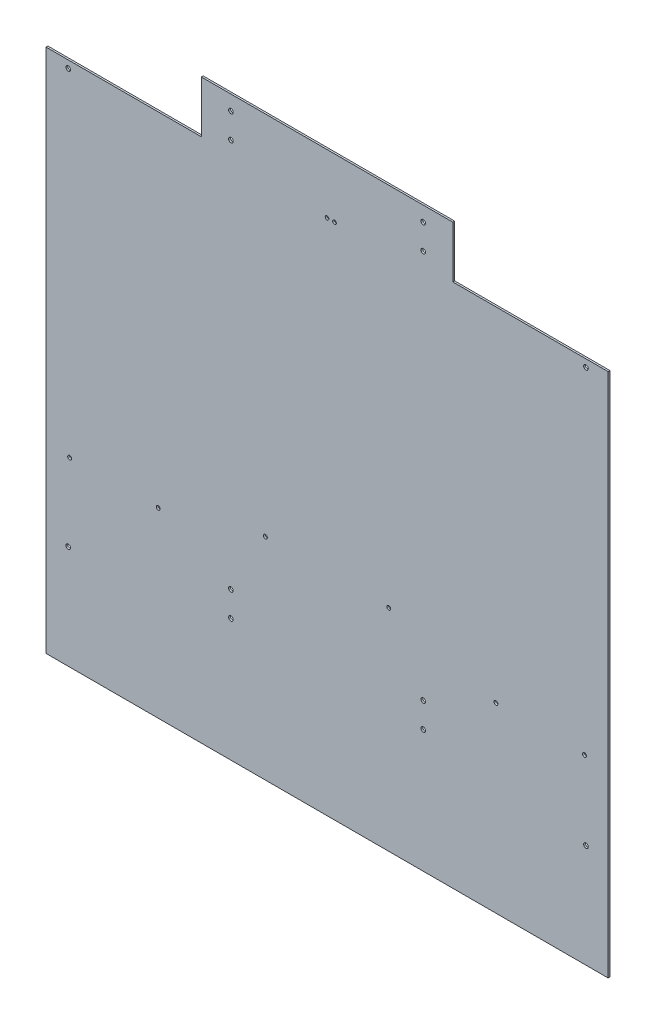
ISO-10303-21;
HEADER;
FILE_DESCRIPTION(('STEP AP214'),'2;1');
FILE_NAME('part.step','',(''),(''),'','','');
FILE_SCHEMA(('AUTOMOTIVE_DESIGN { 1 0 10303 214 1 1 1 1 }'));
ENDSEC;
DATA;
#1=APPLICATION_CONTEXT('core data for automotive mechanical design processes');
#2=APPLICATION_PROTOCOL_DEFINITION('international standard','automotive_design',2000,#1);
#3=PRODUCT_CONTEXT('',#1,'mechanical');
#4=PRODUCT('Part','Part','',(#3));
#5=PRODUCT_RELATED_PRODUCT_CATEGORY('part','',(#4));
#6=PRODUCT_DEFINITION_FORMATION('','',#4);
#7=PRODUCT_DEFINITION_CONTEXT('part definition',#1,'design');
#8=PRODUCT_DEFINITION('design','',#6,#7);
#9=PRODUCT_DEFINITION_SHAPE('','',#8);
#10=(LENGTH_UNIT() NAMED_UNIT(*) SI_UNIT(.MILLI.,.METRE.));
#11=(NAMED_UNIT(*) PLANE_ANGLE_UNIT() SI_UNIT($,.RADIAN.));
#12=(NAMED_UNIT(*) SI_UNIT($,.STERADIAN.) SOLID_ANGLE_UNIT());
#13=UNCERTAINTY_MEASURE_WITH_UNIT(LENGTH_MEASURE(1.E-05),#10,'distance_accuracy_value','');
#14=(GEOMETRIC_REPRESENTATION_CONTEXT(3) GLOBAL_UNCERTAINTY_ASSIGNED_CONTEXT((#13)) GLOBAL_UNIT_ASSIGNED_CONTEXT((#10,
#11,#12)) REPRESENTATION_CONTEXT('',''));
#15=CARTESIAN_POINT('',(0.,0.,0.));
#16=DIRECTION('',(0.,0.,1.));
#17=DIRECTION('',(1.,0.,0.));
#18=AXIS2_PLACEMENT_3D('',#15,#16,#17);
#19=CARTESIAN_POINT('',(0.,0.,0.));
#20=DIRECTION('',(0.,0.,-1.));
#21=DIRECTION('',(-1.,0.,0.));
#22=AXIS2_PLACEMENT_3D('',#19,#20,#21);
#23=PLANE('',#22);
#24=CARTESIAN_POINT('',(0.,889.,0.));
#25=DIRECTION('',(0.,0.,1.));
#26=DIRECTION('',(1.,0.,0.));
#27=AXIS2_PLACEMENT_3D('',#24,#25,#26);
#28=CIRCLE('',#27,3.175);
#29=CARTESIAN_POINT('',(3.175,889.,0.));
#30=VERTEX_POINT('',#29);
#31=EDGE_CURVE('E295',#30,#30,#28,.T.);
#32=ORIENTED_EDGE('',*,*,#31,.T.);
#33=EDGE_LOOP('',(#32));
#34=FACE_BOUND('',#33,.T.);
#35=CARTESIAN_POINT('',(12.7,889.,0.));
#36=DIRECTION('',(0.,0.,1.));
#37=DIRECTION('',(1.,0.,0.));
#38=AXIS2_PLACEMENT_3D('',#35,#36,#37);
#39=CIRCLE('',#38,3.175);
#40=CARTESIAN_POINT('',(15.875,889.,0.));
#41=VERTEX_POINT('',#40);
#42=EDGE_CURVE('E289',#41,#41,#39,.T.);
#43=ORIENTED_EDGE('',*,*,#42,.T.);
#44=EDGE_LOOP('',(#43));
#45=FACE_BOUND('',#44,.T.);
#46=CARTESIAN_POINT('',(-165.1,922.02,0.));
#47=DIRECTION('',(0.,0.,1.));
#48=DIRECTION('',(1.,0.,0.));
#49=AXIS2_PLACEMENT_3D('',#46,#47,#48);
#50=CIRCLE('',#49,3.96874999999999);
#51=CARTESIAN_POINT('',(-161.13125,922.02,0.));
#52=VERTEX_POINT('',#51);
#53=EDGE_CURVE('E283',#52,#52,#50,.T.);
#54=ORIENTED_EDGE('',*,*,#53,.T.);
#55=EDGE_LOOP('',(#54));
#56=FACE_BOUND('',#55,.T.);
#57=CARTESIAN_POINT('',(-165.1,965.2,0.));
#58=DIRECTION('',(0.,0.,1.));
#59=DIRECTION('',(1.,0.,0.));
#60=AXIS2_PLACEMENT_3D('',#57,#58,#59);
#61=CIRCLE('',#60,3.96874999999999);
#62=CARTESIAN_POINT('',(-161.13125,965.2,0.));
#63=VERTEX_POINT('',#62);
#64=EDGE_CURVE('E277',#63,#63,#61,.T.);
#65=ORIENTED_EDGE('',*,*,#64,.T.);
#66=EDGE_LOOP('',(#65));
#67=FACE_BOUND('',#66,.T.);
#68=CARTESIAN_POINT('',(165.099999999979,965.2,0.));
#69=DIRECTION('',(0.,0.,1.));
#70=DIRECTION('',(1.,0.,0.));
#71=AXIS2_PLACEMENT_3D('',#68,#69,#70);
#72=CIRCLE('',#71,3.96874999999999);
#73=CARTESIAN_POINT('',(169.068749999979,965.2,0.));
#74=VERTEX_POINT('',#73);
#75=EDGE_CURVE('E271',#74,#74,#72,.T.);
#76=ORIENTED_EDGE('',*,*,#75,.T.);
#77=EDGE_LOOP('',(#76));
#78=FACE_BOUND('',#77,.T.);
#79=CARTESIAN_POINT('',(165.099999999979,922.02,0.));
#80=DIRECTION('',(0.,0.,1.));
#81=DIRECTION('',(1.,0.,0.));
#82=AXIS2_PLACEMENT_3D('',#79,#80,#81);
#83=CIRCLE('',#82,3.96874999999999);
#84=CARTESIAN_POINT('',(169.068749999979,922.02,0.));
#85=VERTEX_POINT('',#84);
#86=EDGE_CURVE('E265',#85,#85,#83,.T.);
#87=ORIENTED_EDGE('',*,*,#86,.T.);
#88=EDGE_LOOP('',(#87));
#89=FACE_BOUND('',#88,.T.);
#90=CARTESIAN_POINT('',(-165.099999999993,210.82,0.));
#91=DIRECTION('',(0.,0.,1.));
#92=DIRECTION('',(1.,0.,0.));
#93=AXIS2_PLACEMENT_3D('',#90,#91,#92);
#94=CIRCLE('',#93,3.96874999999999);
#95=CARTESIAN_POINT('',(-161.131249999993,210.82,0.));
#96=VERTEX_POINT('',#95);
#97=EDGE_CURVE('E259',#96,#96,#94,.T.);
#98=ORIENTED_EDGE('',*,*,#97,.T.);
#99=EDGE_LOOP('',(#98));
#100=FACE_BOUND('',#99,.T.);
#101=CARTESIAN_POINT('',(-165.099999999993,254.,0.));
#102=DIRECTION('',(0.,0.,1.));
#103=DIRECTION('',(1.,0.,0.));
#104=AXIS2_PLACEMENT_3D('',#101,#102,#103);
#105=CIRCLE('',#104,3.96874999999999);
#106=CARTESIAN_POINT('',(-161.131249999993,254.,0.));
#107=VERTEX_POINT('',#106);
#108=EDGE_CURVE('E253',#107,#107,#105,.T.);
#109=ORIENTED_EDGE('',*,*,#108,.T.);
#110=EDGE_LOOP('',(#109));
#111=FACE_BOUND('',#110,.T.);
#112=CARTESIAN_POINT('',(165.099999999987,254.,0.));
#113=DIRECTION('',(0.,0.,1.));
#114=DIRECTION('',(1.,0.,0.));
#115=AXIS2_PLACEMENT_3D('',#112,#113,#114);
#116=CIRCLE('',#115,3.96874999999999);
#117=CARTESIAN_POINT('',(169.068749999987,254.,0.));
#118=VERTEX_POINT('',#117);
#119=EDGE_CURVE('E247',#118,#118,#116,.T.);
#120=ORIENTED_EDGE('',*,*,#119,.T.);
#121=EDGE_LOOP('',(#120));
#122=FACE_BOUND('',#121,.T.);
#123=DIRECTION('',(0.,-1.,0.));
#124=VECTOR('',#123,1.);
#125=CARTESIAN_POINT('',(-482.6,0.,0.));
#126=LINE('',#125,#124);
#127=CARTESIAN_POINT('',(-482.6,901.7,0.));
#128=VERTEX_POINT('',#127);
#129=CARTESIAN_POINT('',(-482.6,0.,0.));
#130=VERTEX_POINT('',#129);
#131=EDGE_CURVE('E134',#128,#130,#126,.T.);
#132=ORIENTED_EDGE('',*,*,#131,.F.);
#133=DIRECTION('',(-1.,0.,0.));
#134=VECTOR('',#133,1.);
#135=CARTESIAN_POINT('',(-482.6,901.7,0.));
#136=LINE('',#135,#134);
#137=CARTESIAN_POINT('',(-215.9,901.7,0.));
#138=VERTEX_POINT('',#137);
#139=EDGE_CURVE('E88',#138,#128,#136,.T.);
#140=ORIENTED_EDGE('',*,*,#139,.F.);
#141=DIRECTION('',(0.,-1.,0.));
#142=VECTOR('',#141,1.);
#143=CARTESIAN_POINT('',(-215.9,901.7,0.));
#144=LINE('',#143,#142);
#145=CARTESIAN_POINT('',(-215.9,990.6,0.));
#146=VERTEX_POINT('',#145);
#147=EDGE_CURVE('E82',#146,#138,#144,.T.);
#148=ORIENTED_EDGE('',*,*,#147,.F.);
#149=DIRECTION('',(-1.,0.,0.));
#150=VECTOR('',#149,1.);
#151=CARTESIAN_POINT('',(-215.9,990.6,0.));
#152=LINE('',#151,#150);
#153=CARTESIAN_POINT('',(215.9,990.6,0.));
#154=VERTEX_POINT('',#153);
#155=EDGE_CURVE('E124',#154,#146,#152,.T.);
#156=ORIENTED_EDGE('',*,*,#155,.F.);
#157=DIRECTION('',(0.,1.,0.));
#158=VECTOR('',#157,1.);
#159=CARTESIAN_POINT('',(215.9,990.6,0.));
#160=LINE('',#159,#158);
#161=CARTESIAN_POINT('',(215.9,901.7,0.));
#162=VERTEX_POINT('',#161);
#163=EDGE_CURVE('E144',#162,#154,#160,.T.);
#164=ORIENTED_EDGE('',*,*,#163,.F.);
#165=DIRECTION('',(-1.,0.,0.));
#166=VECTOR('',#165,1.);
#167=CARTESIAN_POINT('',(215.9,901.7,0.));
#168=LINE('',#167,#166);
#169=CARTESIAN_POINT('',(482.6,901.7,0.));
#170=VERTEX_POINT('',#169);
#171=EDGE_CURVE('E142',#170,#162,#168,.T.);
#172=ORIENTED_EDGE('',*,*,#171,.F.);
#173=DIRECTION('',(0.,1.,0.));
#174=VECTOR('',#173,1.);
#175=CARTESIAN_POINT('',(482.6,0.,0.));
#176=LINE('',#175,#174);
#177=CARTESIAN_POINT('',(482.6,0.,0.));
#178=VERTEX_POINT('',#177);
#179=EDGE_CURVE('E140',#178,#170,#176,.T.);
#180=ORIENTED_EDGE('',*,*,#179,.F.);
#181=DIRECTION('',(1.,0.,0.));
#182=VECTOR('',#181,1.);
#183=CARTESIAN_POINT('',(-482.6,0.,0.));
#184=LINE('',#183,#182);
#185=EDGE_CURVE('E137',#130,#178,#184,.T.);
#186=ORIENTED_EDGE('',*,*,#185,.F.);
#187=EDGE_LOOP('',(#132,#140,#148,#156,#164,#172,#180,#186));
#188=FACE_BOUND('',#187,.T.);
#189=CARTESIAN_POINT('',(-441.96,311.509186149953,0.));
#190=DIRECTION('',(0.,0.,1.));
#191=DIRECTION('',(1.,0.,0.));
#192=AXIS2_PLACEMENT_3D('',#189,#190,#191);
#193=CIRCLE('',#192,3.3782);
#194=CARTESIAN_POINT('',(-438.5818,311.509186149953,0.));
#195=VERTEX_POINT('',#194);
#196=EDGE_CURVE('E138',#195,#195,#193,.T.);
#197=ORIENTED_EDGE('',*,*,#196,.T.);
#198=EDGE_LOOP('',(#197));
#199=FACE_BOUND('',#198,.T.);
#200=CARTESIAN_POINT('',(441.96,311.509186149953,0.));
#201=DIRECTION('',(0.,0.,1.));
#202=DIRECTION('',(1.,0.,0.));
#203=AXIS2_PLACEMENT_3D('',#200,#201,#202);
#204=CIRCLE('',#203,3.3782);
#205=CARTESIAN_POINT('',(445.3382,311.509186149953,0.));
#206=VERTEX_POINT('',#205);
#207=EDGE_CURVE('E187',#206,#206,#204,.T.);
#208=ORIENTED_EDGE('',*,*,#207,.T.);
#209=EDGE_LOOP('',(#208));
#210=FACE_BOUND('',#209,.T.);
#211=CARTESIAN_POINT('',(-105.907561141766,362.110143282902,0.));
#212=DIRECTION('',(0.,0.,1.));
#213=DIRECTION('',(1.,0.,0.));
#214=AXIS2_PLACEMENT_3D('',#211,#212,#213);
#215=CIRCLE('',#214,3.3782);
#216=CARTESIAN_POINT('',(-102.529361141766,362.110143282902,0.));
#217=VERTEX_POINT('',#216);
#218=EDGE_CURVE('E193',#217,#217,#215,.T.);
#219=ORIENTED_EDGE('',*,*,#218,.T.);
#220=EDGE_LOOP('',(#219));
#221=FACE_BOUND('',#220,.T.);
#222=CARTESIAN_POINT('',(-289.916431049834,312.805115190872,0.));
#223=DIRECTION('',(0.,0.,1.));
#224=DIRECTION('',(1.,0.,0.));
#225=AXIS2_PLACEMENT_3D('',#222,#223,#224);
#226=CIRCLE('',#225,3.3782);
#227=CARTESIAN_POINT('',(-286.538231049834,312.805115190872,0.));
#228=VERTEX_POINT('',#227);
#229=EDGE_CURVE('E199',#228,#228,#226,.T.);
#230=ORIENTED_EDGE('',*,*,#229,.T.);
#231=EDGE_LOOP('',(#230));
#232=FACE_BOUND('',#231,.T.);
#233=CARTESIAN_POINT('',(289.916431049834,312.805115190872,0.));
#234=DIRECTION('',(0.,0.,1.));
#235=DIRECTION('',(1.,0.,0.));
#236=AXIS2_PLACEMENT_3D('',#233,#234,#235);
#237=CIRCLE('',#236,3.3782);
#238=CARTESIAN_POINT('',(293.294631049834,312.805115190872,0.));
#239=VERTEX_POINT('',#238);
#240=EDGE_CURVE('E205',#239,#239,#237,.T.);
#241=ORIENTED_EDGE('',*,*,#240,.T.);
#242=EDGE_LOOP('',(#241));
#243=FACE_BOUND('',#242,.T.);
#244=CARTESIAN_POINT('',(105.907561141766,362.110143282902,0.));
#245=DIRECTION('',(0.,0.,1.));
#246=DIRECTION('',(1.,0.,0.));
#247=AXIS2_PLACEMENT_3D('',#244,#245,#246);
#248=CIRCLE('',#247,3.3782);
#249=CARTESIAN_POINT('',(109.285761141766,362.110143282902,0.));
#250=VERTEX_POINT('',#249);
#251=EDGE_CURVE('E211',#250,#250,#248,.T.);
#252=ORIENTED_EDGE('',*,*,#251,.T.);
#253=EDGE_LOOP('',(#252));
#254=FACE_BOUND('',#253,.T.);
#255=CARTESIAN_POINT('',(444.499999999977,889.,0.));
#256=DIRECTION('',(0.,0.,1.));
#257=DIRECTION('',(1.,0.,0.));
#258=AXIS2_PLACEMENT_3D('',#255,#256,#257);
#259=CIRCLE('',#258,3.96875000000002);
#260=CARTESIAN_POINT('',(448.468749999977,889.,0.));
#261=VERTEX_POINT('',#260);
#262=EDGE_CURVE('E217',#261,#261,#259,.T.);
#263=ORIENTED_EDGE('',*,*,#262,.T.);
#264=EDGE_LOOP('',(#263));
#265=FACE_BOUND('',#264,.T.);
#266=CARTESIAN_POINT('',(-444.500000000002,889.,0.));
#267=DIRECTION('',(0.,0.,1.));
#268=DIRECTION('',(1.,0.,0.));
#269=AXIS2_PLACEMENT_3D('',#266,#267,#268);
#270=CIRCLE('',#269,3.96875000000002);
#271=CARTESIAN_POINT('',(-440.531250000002,889.,0.));
#272=VERTEX_POINT('',#271);
#273=EDGE_CURVE('E223',#272,#272,#270,.T.);
#274=ORIENTED_EDGE('',*,*,#273,.T.);
#275=EDGE_LOOP('',(#274));
#276=FACE_BOUND('',#275,.T.);
#277=CARTESIAN_POINT('',(444.499999999979,177.8,0.));
#278=DIRECTION('',(0.,0.,1.));
#279=DIRECTION('',(1.,0.,0.));
#280=AXIS2_PLACEMENT_3D('',#277,#278,#279);
#281=CIRCLE('',#280,3.96875000000002);
#282=CARTESIAN_POINT('',(448.468749999979,177.8,0.));
#283=VERTEX_POINT('',#282);
#284=EDGE_CURVE('E229',#283,#283,#281,.T.);
#285=ORIENTED_EDGE('',*,*,#284,.T.);
#286=EDGE_LOOP('',(#285));
#287=FACE_BOUND('',#286,.T.);
#288=CARTESIAN_POINT('',(-444.5,177.8,0.));
#289=DIRECTION('',(0.,0.,1.));
#290=DIRECTION('',(1.,0.,0.));
#291=AXIS2_PLACEMENT_3D('',#288,#289,#290);
#292=CIRCLE('',#291,3.96875000000002);
#293=CARTESIAN_POINT('',(-440.53125,177.8,0.));
#294=VERTEX_POINT('',#293);
#295=EDGE_CURVE('E235',#294,#294,#292,.T.);
#296=ORIENTED_EDGE('',*,*,#295,.T.);
#297=EDGE_LOOP('',(#296));
#298=FACE_BOUND('',#297,.T.);
#299=CARTESIAN_POINT('',(165.099999999987,210.82,0.));
#300=DIRECTION('',(0.,0.,1.));
#301=DIRECTION('',(1.,0.,0.));
#302=AXIS2_PLACEMENT_3D('',#299,#300,#301);
#303=CIRCLE('',#302,3.96874999999999);
#304=CARTESIAN_POINT('',(169.068749999987,210.82,0.));
#305=VERTEX_POINT('',#304);
#306=EDGE_CURVE('E241',#305,#305,#303,.T.);
#307=ORIENTED_EDGE('',*,*,#306,.T.);
#308=EDGE_LOOP('',(#307));
#309=FACE_BOUND('',#308,.T.);
#310=ADVANCED_FACE('F36',(#34,#45,#56,#67,#78,#89,#100,#111,#122,#188,#199,#210,#221,#232,#243,
#254,#265,#276,#287,#298,#309),#23,.T.);
#311=CARTESIAN_POINT('',(0.,0.,3.175));
#312=DIRECTION('',(0.,0.,-1.));
#313=DIRECTION('',(-1.,0.,0.));
#314=AXIS2_PLACEMENT_3D('',#311,#312,#313);
#315=PLANE('',#314);
#316=CARTESIAN_POINT('',(0.,889.,3.175));
#317=DIRECTION('',(0.,0.,1.));
#318=DIRECTION('',(1.,0.,0.));
#319=AXIS2_PLACEMENT_3D('',#316,#317,#318);
#320=CIRCLE('',#319,3.17499999999999);
#321=CARTESIAN_POINT('',(3.17499999999999,889.,3.175));
#322=VERTEX_POINT('',#321);
#323=EDGE_CURVE('E298',#322,#322,#320,.T.);
#324=ORIENTED_EDGE('',*,*,#323,.F.);
#325=EDGE_LOOP('',(#324));
#326=FACE_BOUND('',#325,.T.);
#327=CARTESIAN_POINT('',(12.7,889.,3.175));
#328=DIRECTION('',(0.,0.,1.));
#329=DIRECTION('',(1.,0.,0.));
#330=AXIS2_PLACEMENT_3D('',#327,#328,#329);
#331=CIRCLE('',#330,3.17499999999999);
#332=CARTESIAN_POINT('',(15.875,889.,3.175));
#333=VERTEX_POINT('',#332);
#334=EDGE_CURVE('E292',#333,#333,#331,.T.);
#335=ORIENTED_EDGE('',*,*,#334,.F.);
#336=EDGE_LOOP('',(#335));
#337=FACE_BOUND('',#336,.T.);
#338=CARTESIAN_POINT('',(-165.1,922.02,3.175));
#339=DIRECTION('',(0.,0.,1.));
#340=DIRECTION('',(1.,0.,0.));
#341=AXIS2_PLACEMENT_3D('',#338,#339,#340);
#342=CIRCLE('',#341,3.96874999999999);
#343=CARTESIAN_POINT('',(-161.13125,922.02,3.175));
#344=VERTEX_POINT('',#343);
#345=EDGE_CURVE('E286',#344,#344,#342,.T.);
#346=ORIENTED_EDGE('',*,*,#345,.F.);
#347=EDGE_LOOP('',(#346));
#348=FACE_BOUND('',#347,.T.);
#349=CARTESIAN_POINT('',(-165.1,965.2,3.175));
#350=DIRECTION('',(0.,0.,1.));
#351=DIRECTION('',(1.,0.,0.));
#352=AXIS2_PLACEMENT_3D('',#349,#350,#351);
#353=CIRCLE('',#352,3.96874999999999);
#354=CARTESIAN_POINT('',(-161.13125,965.2,3.175));
#355=VERTEX_POINT('',#354);
#356=EDGE_CURVE('E280',#355,#355,#353,.T.);
#357=ORIENTED_EDGE('',*,*,#356,.F.);
#358=EDGE_LOOP('',(#357));
#359=FACE_BOUND('',#358,.T.);
#360=CARTESIAN_POINT('',(165.099999999979,965.2,3.175));
#361=DIRECTION('',(0.,0.,1.));
#362=DIRECTION('',(1.,0.,0.));
#363=AXIS2_PLACEMENT_3D('',#360,#361,#362);
#364=CIRCLE('',#363,3.96874999999999);
#365=CARTESIAN_POINT('',(169.068749999979,965.2,3.175));
#366=VERTEX_POINT('',#365);
#367=EDGE_CURVE('E274',#366,#366,#364,.T.);
#368=ORIENTED_EDGE('',*,*,#367,.F.);
#369=EDGE_LOOP('',(#368));
#370=FACE_BOUND('',#369,.T.);
#371=CARTESIAN_POINT('',(165.099999999979,922.02,3.175));
#372=DIRECTION('',(0.,0.,1.));
#373=DIRECTION('',(1.,0.,0.));
#374=AXIS2_PLACEMENT_3D('',#371,#372,#373);
#375=CIRCLE('',#374,3.96874999999999);
#376=CARTESIAN_POINT('',(169.068749999979,922.02,3.175));
#377=VERTEX_POINT('',#376);
#378=EDGE_CURVE('E268',#377,#377,#375,.T.);
#379=ORIENTED_EDGE('',*,*,#378,.F.);
#380=EDGE_LOOP('',(#379));
#381=FACE_BOUND('',#380,.T.);
#382=CARTESIAN_POINT('',(-165.099999999993,210.82,3.175));
#383=DIRECTION('',(0.,0.,1.));
#384=DIRECTION('',(1.,0.,0.));
#385=AXIS2_PLACEMENT_3D('',#382,#383,#384);
#386=CIRCLE('',#385,3.96874999999999);
#387=CARTESIAN_POINT('',(-161.131249999993,210.82,3.175));
#388=VERTEX_POINT('',#387);
#389=EDGE_CURVE('E262',#388,#388,#386,.T.);
#390=ORIENTED_EDGE('',*,*,#389,.F.);
#391=EDGE_LOOP('',(#390));
#392=FACE_BOUND('',#391,.T.);
#393=CARTESIAN_POINT('',(-165.099999999993,254.,3.175));
#394=DIRECTION('',(0.,0.,1.));
#395=DIRECTION('',(1.,0.,0.));
#396=AXIS2_PLACEMENT_3D('',#393,#394,#395);
#397=CIRCLE('',#396,3.96874999999999);
#398=CARTESIAN_POINT('',(-161.131249999993,254.,3.175));
#399=VERTEX_POINT('',#398);
#400=EDGE_CURVE('E256',#399,#399,#397,.T.);
#401=ORIENTED_EDGE('',*,*,#400,.F.);
#402=EDGE_LOOP('',(#401));
#403=FACE_BOUND('',#402,.T.);
#404=CARTESIAN_POINT('',(165.099999999987,254.,3.175));
#405=DIRECTION('',(0.,0.,1.));
#406=DIRECTION('',(1.,0.,0.));
#407=AXIS2_PLACEMENT_3D('',#404,#405,#406);
#408=CIRCLE('',#407,3.96874999999999);
#409=CARTESIAN_POINT('',(169.068749999987,254.,3.175));
#410=VERTEX_POINT('',#409);
#411=EDGE_CURVE('E250',#410,#410,#408,.T.);
#412=ORIENTED_EDGE('',*,*,#411,.F.);
#413=EDGE_LOOP('',(#412));
#414=FACE_BOUND('',#413,.T.);
#415=CARTESIAN_POINT('',(165.099999999987,210.82,3.175));
#416=DIRECTION('',(0.,0.,1.));
#417=DIRECTION('',(1.,0.,0.));
#418=AXIS2_PLACEMENT_3D('',#415,#416,#417);
#419=CIRCLE('',#418,3.96874999999999);
#420=CARTESIAN_POINT('',(169.068749999987,210.82,3.175));
#421=VERTEX_POINT('',#420);
#422=EDGE_CURVE('E244',#421,#421,#419,.T.);
#423=ORIENTED_EDGE('',*,*,#422,.F.);
#424=EDGE_LOOP('',(#423));
#425=FACE_BOUND('',#424,.T.);
#426=CARTESIAN_POINT('',(-444.5,177.8,3.175));
#427=DIRECTION('',(0.,0.,1.));
#428=DIRECTION('',(1.,0.,0.));
#429=AXIS2_PLACEMENT_3D('',#426,#427,#428);
#430=CIRCLE('',#429,3.96875000000002);
#431=CARTESIAN_POINT('',(-440.53125,177.8,3.175));
#432=VERTEX_POINT('',#431);
#433=EDGE_CURVE('E238',#432,#432,#430,.T.);
#434=ORIENTED_EDGE('',*,*,#433,.F.);
#435=EDGE_LOOP('',(#434));
#436=FACE_BOUND('',#435,.T.);
#437=CARTESIAN_POINT('',(444.499999999979,177.8,3.175));
#438=DIRECTION('',(0.,0.,1.));
#439=DIRECTION('',(1.,0.,0.));
#440=AXIS2_PLACEMENT_3D('',#437,#438,#439);
#441=CIRCLE('',#440,3.96875000000002);
#442=CARTESIAN_POINT('',(448.468749999979,177.8,3.175));
#443=VERTEX_POINT('',#442);
#444=EDGE_CURVE('E232',#443,#443,#441,.T.);
#445=ORIENTED_EDGE('',*,*,#444,.F.);
#446=EDGE_LOOP('',(#445));
#447=FACE_BOUND('',#446,.T.);
#448=CARTESIAN_POINT('',(444.499999999977,889.,3.175));
#449=DIRECTION('',(0.,0.,1.));
#450=DIRECTION('',(1.,0.,0.));
#451=AXIS2_PLACEMENT_3D('',#448,#449,#450);
#452=CIRCLE('',#451,3.96875000000002);
#453=CARTESIAN_POINT('',(448.468749999977,889.,3.175));
#454=VERTEX_POINT('',#453);
#455=EDGE_CURVE('E220',#454,#454,#452,.T.);
#456=ORIENTED_EDGE('',*,*,#455,.F.);
#457=EDGE_LOOP('',(#456));
#458=FACE_BOUND('',#457,.T.);
#459=CARTESIAN_POINT('',(105.907561141766,362.110143282902,3.175));
#460=DIRECTION('',(0.,0.,1.));
#461=DIRECTION('',(1.,0.,0.));
#462=AXIS2_PLACEMENT_3D('',#459,#460,#461);
#463=CIRCLE('',#462,3.37819999999998);
#464=CARTESIAN_POINT('',(109.285761141766,362.110143282902,3.175));
#465=VERTEX_POINT('',#464);
#466=EDGE_CURVE('E214',#465,#465,#463,.T.);
#467=ORIENTED_EDGE('',*,*,#466,.F.);
#468=EDGE_LOOP('',(#467));
#469=FACE_BOUND('',#468,.T.);
#470=CARTESIAN_POINT('',(289.916431049834,312.805115190872,3.175));
#471=DIRECTION('',(0.,0.,1.));
#472=DIRECTION('',(1.,0.,0.));
#473=AXIS2_PLACEMENT_3D('',#470,#471,#472);
#474=CIRCLE('',#473,3.3782);
#475=CARTESIAN_POINT('',(293.294631049834,312.805115190872,3.175));
#476=VERTEX_POINT('',#475);
#477=EDGE_CURVE('E208',#476,#476,#474,.T.);
#478=ORIENTED_EDGE('',*,*,#477,.F.);
#479=EDGE_LOOP('',(#478));
#480=FACE_BOUND('',#479,.T.);
#481=CARTESIAN_POINT('',(-289.916431049834,312.805115190872,3.175));
#482=DIRECTION('',(0.,0.,1.));
#483=DIRECTION('',(1.,0.,0.));
#484=AXIS2_PLACEMENT_3D('',#481,#482,#483);
#485=CIRCLE('',#484,3.3782);
#486=CARTESIAN_POINT('',(-286.538231049834,312.805115190872,3.175));
#487=VERTEX_POINT('',#486);
#488=EDGE_CURVE('E202',#487,#487,#485,.T.);
#489=ORIENTED_EDGE('',*,*,#488,.F.);
#490=EDGE_LOOP('',(#489));
#491=FACE_BOUND('',#490,.T.);
#492=CARTESIAN_POINT('',(-105.907561141766,362.110143282902,3.175));
#493=DIRECTION('',(0.,0.,1.));
#494=DIRECTION('',(1.,0.,0.));
#495=AXIS2_PLACEMENT_3D('',#492,#493,#494);
#496=CIRCLE('',#495,3.37819999999998);
#497=CARTESIAN_POINT('',(-102.529361141766,362.110143282902,3.175));
#498=VERTEX_POINT('',#497);
#499=EDGE_CURVE('E196',#498,#498,#496,.T.);
#500=ORIENTED_EDGE('',*,*,#499,.F.);
#501=EDGE_LOOP('',(#500));
#502=FACE_BOUND('',#501,.T.);
#503=CARTESIAN_POINT('',(441.96,311.509186149953,3.175));
#504=DIRECTION('',(0.,0.,1.));
#505=DIRECTION('',(1.,0.,0.));
#506=AXIS2_PLACEMENT_3D('',#503,#504,#505);
#507=CIRCLE('',#506,3.3782);
#508=CARTESIAN_POINT('',(445.3382,311.509186149953,3.175));
#509=VERTEX_POINT('',#508);
#510=EDGE_CURVE('E190',#509,#509,#507,.T.);
#511=ORIENTED_EDGE('',*,*,#510,.F.);
#512=EDGE_LOOP('',(#511));
#513=FACE_BOUND('',#512,.T.);
#514=CARTESIAN_POINT('',(-441.96,311.509186149953,3.175));
#515=DIRECTION('',(0.,0.,1.));
#516=DIRECTION('',(1.,0.,0.));
#517=AXIS2_PLACEMENT_3D('',#514,#515,#516);
#518=CIRCLE('',#517,3.3782);
#519=CARTESIAN_POINT('',(-438.5818,311.509186149953,3.175));
#520=VERTEX_POINT('',#519);
#521=EDGE_CURVE('E184',#520,#520,#518,.T.);
#522=ORIENTED_EDGE('',*,*,#521,.F.);
#523=EDGE_LOOP('',(#522));
#524=FACE_BOUND('',#523,.T.);
#525=DIRECTION('',(0.,-1.,0.));
#526=VECTOR('',#525,1.);
#527=CARTESIAN_POINT('',(-482.6,0.,3.175));
#528=LINE('',#527,#526);
#529=CARTESIAN_POINT('',(-482.6,901.7,3.175));
#530=VERTEX_POINT('',#529);
#531=CARTESIAN_POINT('',(-482.6,0.,3.175));
#532=VERTEX_POINT('',#531);
#533=EDGE_CURVE('E149',#530,#532,#528,.T.);
#534=ORIENTED_EDGE('',*,*,#533,.T.);
#535=DIRECTION('',(1.,0.,0.));
#536=VECTOR('',#535,1.);
#537=CARTESIAN_POINT('',(-482.6,0.,3.175));
#538=LINE('',#537,#536);
#539=CARTESIAN_POINT('',(482.6,0.,3.175));
#540=VERTEX_POINT('',#539);
#541=EDGE_CURVE('E96',#532,#540,#538,.T.);
#542=ORIENTED_EDGE('',*,*,#541,.T.);
#543=DIRECTION('',(0.,1.,0.));
#544=VECTOR('',#543,1.);
#545=CARTESIAN_POINT('',(482.6,0.,3.175));
#546=LINE('',#545,#544);
#547=CARTESIAN_POINT('',(482.6,901.7,3.175));
#548=VERTEX_POINT('',#547);
#549=EDGE_CURVE('E164',#540,#548,#546,.T.);
#550=ORIENTED_EDGE('',*,*,#549,.T.);
#551=DIRECTION('',(-1.,0.,0.));
#552=VECTOR('',#551,1.);
#553=CARTESIAN_POINT('',(215.9,901.7,3.175));
#554=LINE('',#553,#552);
#555=CARTESIAN_POINT('',(215.9,901.7,3.175));
#556=VERTEX_POINT('',#555);
#557=EDGE_CURVE('E176',#548,#556,#554,.T.);
#558=ORIENTED_EDGE('',*,*,#557,.T.);
#559=DIRECTION('',(0.,1.,0.));
#560=VECTOR('',#559,1.);
#561=CARTESIAN_POINT('',(215.9,990.6,3.175));
#562=LINE('',#561,#560);
#563=CARTESIAN_POINT('',(215.9,990.6,3.175));
#564=VERTEX_POINT('',#563);
#565=EDGE_CURVE('E116',#556,#564,#562,.T.);
#566=ORIENTED_EDGE('',*,*,#565,.T.);
#567=DIRECTION('',(-1.,0.,0.));
#568=VECTOR('',#567,1.);
#569=CARTESIAN_POINT('',(-215.9,990.6,3.175));
#570=LINE('',#569,#568);
#571=CARTESIAN_POINT('',(-215.9,990.6,3.175));
#572=VERTEX_POINT('',#571);
#573=EDGE_CURVE('E109',#564,#572,#570,.T.);
#574=ORIENTED_EDGE('',*,*,#573,.T.);
#575=DIRECTION('',(0.,-1.,0.));
#576=VECTOR('',#575,1.);
#577=CARTESIAN_POINT('',(-215.9,901.7,3.175));
#578=LINE('',#577,#576);
#579=CARTESIAN_POINT('',(-215.9,901.7,3.175));
#580=VERTEX_POINT('',#579);
#581=EDGE_CURVE('E114',#572,#580,#578,.T.);
#582=ORIENTED_EDGE('',*,*,#581,.T.);
#583=DIRECTION('',(-1.,0.,0.));
#584=VECTOR('',#583,1.);
#585=CARTESIAN_POINT('',(-482.6,901.7,3.175));
#586=LINE('',#585,#584);
#587=EDGE_CURVE('E53',#580,#530,#586,.T.);
#588=ORIENTED_EDGE('',*,*,#587,.T.);
#589=EDGE_LOOP('',(#534,#542,#550,#558,#566,#574,#582,#588));
#590=FACE_BOUND('',#589,.T.);
#591=CARTESIAN_POINT('',(-444.500000000002,889.,3.175));
#592=DIRECTION('',(0.,0.,1.));
#593=DIRECTION('',(1.,0.,0.));
#594=AXIS2_PLACEMENT_3D('',#591,#592,#593);
#595=CIRCLE('',#594,3.96875000000002);
#596=CARTESIAN_POINT('',(-440.531250000002,889.,3.175));
#597=VERTEX_POINT('',#596);
#598=EDGE_CURVE('E226',#597,#597,#595,.T.);
#599=ORIENTED_EDGE('',*,*,#598,.F.);
#600=EDGE_LOOP('',(#599));
#601=FACE_BOUND('',#600,.T.);
#602=ADVANCED_FACE('F111',(#326,#337,#348,#359,#370,#381,#392,#403,#414,#425,#436,#447,#458,
#469,#480,#491,#502,#513,#524,#590,#601),#315,.F.);
#603=CARTESIAN_POINT('',(-482.6,0.,3.175));
#604=DIRECTION('',(1.,0.,0.));
#605=DIRECTION('',(0.,0.,-1.));
#606=AXIS2_PLACEMENT_3D('',#603,#604,#605);
#607=PLANE('',#606);
#608=ORIENTED_EDGE('',*,*,#131,.T.);
#609=DIRECTION('',(0.,0.,-1.));
#610=VECTOR('',#609,1.);
#611=CARTESIAN_POINT('',(-482.6,0.,3.175));
#612=LINE('',#611,#610);
#613=EDGE_CURVE('E11',#532,#130,#612,.T.);
#614=ORIENTED_EDGE('',*,*,#613,.F.);
#615=ORIENTED_EDGE('',*,*,#533,.F.);
#616=DIRECTION('',(0.,0.,-1.));
#617=VECTOR('',#616,1.);
#618=CARTESIAN_POINT('',(-482.6,901.7,3.175));
#619=LINE('',#618,#617);
#620=EDGE_CURVE('E130',#530,#128,#619,.T.);
#621=ORIENTED_EDGE('',*,*,#620,.T.);
#622=EDGE_LOOP('',(#608,#614,#615,#621));
#623=FACE_BOUND('',#622,.T.);
#624=ADVANCED_FACE('F38',(#623),#607,.F.);
#625=CARTESIAN_POINT('',(-482.6,0.,3.175));
#626=DIRECTION('',(0.,1.,0.));
#627=DIRECTION('',(0.,0.,1.));
#628=AXIS2_PLACEMENT_3D('',#625,#626,#627);
#629=PLANE('',#628);
#630=ORIENTED_EDGE('',*,*,#185,.T.);
#631=DIRECTION('',(0.,0.,-1.));
#632=VECTOR('',#631,1.);
#633=CARTESIAN_POINT('',(482.6,0.,3.175));
#634=LINE('',#633,#632);
#635=EDGE_CURVE('E45',#540,#178,#634,.T.);
#636=ORIENTED_EDGE('',*,*,#635,.F.);
#637=ORIENTED_EDGE('',*,*,#541,.F.);
#638=ORIENTED_EDGE('',*,*,#613,.T.);
#639=EDGE_LOOP('',(#630,#636,#637,#638));
#640=FACE_BOUND('',#639,.T.);
#641=ADVANCED_FACE('F375',(#640),#629,.F.);
#642=CARTESIAN_POINT('',(482.6,0.,3.175));
#643=DIRECTION('',(-1.,0.,0.));
#644=DIRECTION('',(0.,0.,1.));
#645=AXIS2_PLACEMENT_3D('',#642,#643,#644);
#646=PLANE('',#645);
#647=ORIENTED_EDGE('',*,*,#179,.T.);
#648=DIRECTION('',(0.,0.,-1.));
#649=VECTOR('',#648,1.);
#650=CARTESIAN_POINT('',(482.6,901.7,3.175));
#651=LINE('',#650,#649);
#652=EDGE_CURVE('E156',#548,#170,#651,.T.);
#653=ORIENTED_EDGE('',*,*,#652,.F.);
#654=ORIENTED_EDGE('',*,*,#549,.F.);
#655=ORIENTED_EDGE('',*,*,#635,.T.);
#656=EDGE_LOOP('',(#647,#653,#654,#655));
#657=FACE_BOUND('',#656,.T.);
#658=ADVANCED_FACE('F162',(#657),#646,.F.);
#659=CARTESIAN_POINT('',(215.9,901.7,3.175));
#660=DIRECTION('',(0.,-1.,0.));
#661=DIRECTION('',(0.,0.,-1.));
#662=AXIS2_PLACEMENT_3D('',#659,#660,#661);
#663=PLANE('',#662);
#664=ORIENTED_EDGE('',*,*,#171,.T.);
#665=DIRECTION('',(0.,0.,-1.));
#666=VECTOR('',#665,1.);
#667=CARTESIAN_POINT('',(215.9,901.7,3.175));
#668=LINE('',#667,#666);
#669=EDGE_CURVE('E153',#556,#162,#668,.T.);
#670=ORIENTED_EDGE('',*,*,#669,.F.);
#671=ORIENTED_EDGE('',*,*,#557,.F.);
#672=ORIENTED_EDGE('',*,*,#652,.T.);
#673=EDGE_LOOP('',(#664,#670,#671,#672));
#674=FACE_BOUND('',#673,.T.);
#675=ADVANCED_FACE('F172',(#674),#663,.F.);
#676=CARTESIAN_POINT('',(215.9,990.6,3.175));
#677=DIRECTION('',(-1.,0.,0.));
#678=DIRECTION('',(0.,0.,1.));
#679=AXIS2_PLACEMENT_3D('',#676,#677,#678);
#680=PLANE('',#679);
#681=ORIENTED_EDGE('',*,*,#163,.T.);
#682=DIRECTION('',(0.,0.,-1.));
#683=VECTOR('',#682,1.);
#684=CARTESIAN_POINT('',(215.9,990.6,3.175));
#685=LINE('',#684,#683);
#686=EDGE_CURVE('E125',#564,#154,#685,.T.);
#687=ORIENTED_EDGE('',*,*,#686,.F.);
#688=ORIENTED_EDGE('',*,*,#565,.F.);
#689=ORIENTED_EDGE('',*,*,#669,.T.);
#690=EDGE_LOOP('',(#681,#687,#688,#689));
#691=FACE_BOUND('',#690,.T.);
#692=ADVANCED_FACE('F175',(#691),#680,.F.);
#693=CARTESIAN_POINT('',(-215.9,990.6,3.175));
#694=DIRECTION('',(0.,-1.,0.));
#695=DIRECTION('',(0.,0.,-1.));
#696=AXIS2_PLACEMENT_3D('',#693,#694,#695);
#697=PLANE('',#696);
#698=ORIENTED_EDGE('',*,*,#155,.T.);
#699=DIRECTION('',(0.,0.,-1.));
#700=VECTOR('',#699,1.);
#701=CARTESIAN_POINT('',(-215.9,990.6,3.175));
#702=LINE('',#701,#700);
#703=EDGE_CURVE('E121',#572,#146,#702,.T.);
#704=ORIENTED_EDGE('',*,*,#703,.F.);
#705=ORIENTED_EDGE('',*,*,#573,.F.);
#706=ORIENTED_EDGE('',*,*,#686,.T.);
#707=EDGE_LOOP('',(#698,#704,#705,#706));
#708=FACE_BOUND('',#707,.T.);
#709=ADVANCED_FACE('F122',(#708),#697,.F.);
#710=CARTESIAN_POINT('',(-215.9,901.7,3.175));
#711=DIRECTION('',(1.,0.,0.));
#712=DIRECTION('',(0.,0.,-1.));
#713=AXIS2_PLACEMENT_3D('',#710,#711,#712);
#714=PLANE('',#713);
#715=ORIENTED_EDGE('',*,*,#147,.T.);
#716=DIRECTION('',(0.,0.,-1.));
#717=VECTOR('',#716,1.);
#718=CARTESIAN_POINT('',(-215.9,901.7,3.175));
#719=LINE('',#718,#717);
#720=EDGE_CURVE('E126',#580,#138,#719,.T.);
#721=ORIENTED_EDGE('',*,*,#720,.F.);
#722=ORIENTED_EDGE('',*,*,#581,.F.);
#723=ORIENTED_EDGE('',*,*,#703,.T.);
#724=EDGE_LOOP('',(#715,#721,#722,#723));
#725=FACE_BOUND('',#724,.T.);
#726=ADVANCED_FACE('F128',(#725),#714,.F.);
#727=CARTESIAN_POINT('',(-482.6,901.7,3.175));
#728=DIRECTION('',(0.,-1.,0.));
#729=DIRECTION('',(0.,0.,-1.));
#730=AXIS2_PLACEMENT_3D('',#727,#728,#729);
#731=PLANE('',#730);
#732=ORIENTED_EDGE('',*,*,#139,.T.);
#733=ORIENTED_EDGE('',*,*,#620,.F.);
#734=ORIENTED_EDGE('',*,*,#587,.F.);
#735=ORIENTED_EDGE('',*,*,#720,.T.);
#736=EDGE_LOOP('',(#732,#733,#734,#735));
#737=FACE_BOUND('',#736,.T.);
#738=ADVANCED_FACE('F346',(#737),#731,.F.);
#739=CARTESIAN_POINT('',(-441.96,311.509186149953,3.175));
#740=DIRECTION('',(0.,0.,1.));
#741=DIRECTION('',(1.,0.,0.));
#742=AXIS2_PLACEMENT_3D('',#739,#740,#741);
#743=CYLINDRICAL_SURFACE('',#742,3.3782);
#744=ORIENTED_EDGE('',*,*,#196,.F.);
#745=EDGE_LOOP('',(#744));
#746=FACE_BOUND('',#745,.T.);
#747=ORIENTED_EDGE('',*,*,#521,.T.);
#748=EDGE_LOOP('',(#747));
#749=FACE_BOUND('',#748,.T.);
#750=ADVANCED_FACE('F343',(#746,#749),#743,.F.);
#751=CARTESIAN_POINT('',(441.96,311.509186149953,3.175));
#752=DIRECTION('',(0.,0.,1.));
#753=DIRECTION('',(1.,0.,0.));
#754=AXIS2_PLACEMENT_3D('',#751,#752,#753);
#755=CYLINDRICAL_SURFACE('',#754,3.3782);
#756=ORIENTED_EDGE('',*,*,#207,.F.);
#757=EDGE_LOOP('',(#756));
#758=FACE_BOUND('',#757,.T.);
#759=ORIENTED_EDGE('',*,*,#510,.T.);
#760=EDGE_LOOP('',(#759));
#761=FACE_BOUND('',#760,.T.);
#762=ADVANCED_FACE('F345',(#758,#761),#755,.F.);
#763=CARTESIAN_POINT('',(-105.907561141766,362.110143282902,3.175));
#764=DIRECTION('',(0.,0.,1.));
#765=DIRECTION('',(1.,0.,0.));
#766=AXIS2_PLACEMENT_3D('',#763,#764,#765);
#767=CYLINDRICAL_SURFACE('',#766,3.37819999999999);
#768=ORIENTED_EDGE('',*,*,#218,.F.);
#769=EDGE_LOOP('',(#768));
#770=FACE_BOUND('',#769,.T.);
#771=ORIENTED_EDGE('',*,*,#499,.T.);
#772=EDGE_LOOP('',(#771));
#773=FACE_BOUND('',#772,.T.);
#774=ADVANCED_FACE('F353',(#770,#773),#767,.F.);
#775=CARTESIAN_POINT('',(-289.916431049834,312.805115190872,3.175));
#776=DIRECTION('',(0.,0.,1.));
#777=DIRECTION('',(1.,0.,0.));
#778=AXIS2_PLACEMENT_3D('',#775,#776,#777);
#779=CYLINDRICAL_SURFACE('',#778,3.3782);
#780=ORIENTED_EDGE('',*,*,#229,.F.);
#781=EDGE_LOOP('',(#780));
#782=FACE_BOUND('',#781,.T.);
#783=ORIENTED_EDGE('',*,*,#488,.T.);
#784=EDGE_LOOP('',(#783));
#785=FACE_BOUND('',#784,.T.);
#786=ADVANCED_FACE('F548',(#782,#785),#779,.F.);
#787=CARTESIAN_POINT('',(289.916431049834,312.805115190872,3.175));
#788=DIRECTION('',(0.,0.,1.));
#789=DIRECTION('',(1.,0.,0.));
#790=AXIS2_PLACEMENT_3D('',#787,#788,#789);
#791=CYLINDRICAL_SURFACE('',#790,3.3782);
#792=ORIENTED_EDGE('',*,*,#240,.F.);
#793=EDGE_LOOP('',(#792));
#794=FACE_BOUND('',#793,.T.);
#795=ORIENTED_EDGE('',*,*,#477,.T.);
#796=EDGE_LOOP('',(#795));
#797=FACE_BOUND('',#796,.T.);
#798=ADVANCED_FACE('F541',(#794,#797),#791,.F.);
#799=CARTESIAN_POINT('',(105.907561141766,362.110143282902,3.175));
#800=DIRECTION('',(0.,0.,1.));
#801=DIRECTION('',(1.,0.,0.));
#802=AXIS2_PLACEMENT_3D('',#799,#800,#801);
#803=CYLINDRICAL_SURFACE('',#802,3.37819999999999);
#804=ORIENTED_EDGE('',*,*,#251,.F.);
#805=EDGE_LOOP('',(#804));
#806=FACE_BOUND('',#805,.T.);
#807=ORIENTED_EDGE('',*,*,#466,.T.);
#808=EDGE_LOOP('',(#807));
#809=FACE_BOUND('',#808,.T.);
#810=ADVANCED_FACE('F407',(#806,#809),#803,.F.);
#811=CARTESIAN_POINT('',(444.499999999977,889.,3.175));
#812=DIRECTION('',(0.,0.,1.));
#813=DIRECTION('',(1.,0.,0.));
#814=AXIS2_PLACEMENT_3D('',#811,#812,#813);
#815=CYLINDRICAL_SURFACE('',#814,3.96875000000002);
#816=ORIENTED_EDGE('',*,*,#262,.F.);
#817=EDGE_LOOP('',(#816));
#818=FACE_BOUND('',#817,.T.);
#819=ORIENTED_EDGE('',*,*,#455,.T.);
#820=EDGE_LOOP('',(#819));
#821=FACE_BOUND('',#820,.T.);
#822=ADVANCED_FACE('F400',(#818,#821),#815,.F.);
#823=CARTESIAN_POINT('',(-444.500000000002,889.,3.175));
#824=DIRECTION('',(0.,0.,1.));
#825=DIRECTION('',(1.,0.,0.));
#826=AXIS2_PLACEMENT_3D('',#823,#824,#825);
#827=CYLINDRICAL_SURFACE('',#826,3.96875000000002);
#828=ORIENTED_EDGE('',*,*,#273,.F.);
#829=EDGE_LOOP('',(#828));
#830=FACE_BOUND('',#829,.T.);
#831=ORIENTED_EDGE('',*,*,#598,.T.);
#832=EDGE_LOOP('',(#831));
#833=FACE_BOUND('',#832,.T.);
#834=ADVANCED_FACE('F406',(#830,#833),#827,.F.);
#835=CARTESIAN_POINT('',(444.499999999979,177.8,3.175));
#836=DIRECTION('',(0.,0.,1.));
#837=DIRECTION('',(1.,0.,0.));
#838=AXIS2_PLACEMENT_3D('',#835,#836,#837);
#839=CYLINDRICAL_SURFACE('',#838,3.96875000000002);
#840=ORIENTED_EDGE('',*,*,#284,.F.);
#841=EDGE_LOOP('',(#840));
#842=FACE_BOUND('',#841,.T.);
#843=ORIENTED_EDGE('',*,*,#444,.T.);
#844=EDGE_LOOP('',(#843));
#845=FACE_BOUND('',#844,.T.);
#846=ADVANCED_FACE('F417',(#842,#845),#839,.F.);
#847=CARTESIAN_POINT('',(-444.5,177.8,3.175));
#848=DIRECTION('',(0.,0.,1.));
#849=DIRECTION('',(1.,0.,0.));
#850=AXIS2_PLACEMENT_3D('',#847,#848,#849);
#851=CYLINDRICAL_SURFACE('',#850,3.96875000000002);
#852=ORIENTED_EDGE('',*,*,#295,.F.);
#853=EDGE_LOOP('',(#852));
#854=FACE_BOUND('',#853,.T.);
#855=ORIENTED_EDGE('',*,*,#433,.T.);
#856=EDGE_LOOP('',(#855));
#857=FACE_BOUND('',#856,.T.);
#858=ADVANCED_FACE('F426',(#854,#857),#851,.F.);
#859=CARTESIAN_POINT('',(165.099999999987,210.82,3.175));
#860=DIRECTION('',(0.,0.,1.));
#861=DIRECTION('',(1.,0.,0.));
#862=AXIS2_PLACEMENT_3D('',#859,#860,#861);
#863=CYLINDRICAL_SURFACE('',#862,3.96874999999999);
#864=ORIENTED_EDGE('',*,*,#306,.F.);
#865=EDGE_LOOP('',(#864));
#866=FACE_BOUND('',#865,.T.);
#867=ORIENTED_EDGE('',*,*,#422,.T.);
#868=EDGE_LOOP('',(#867));
#869=FACE_BOUND('',#868,.T.);
#870=ADVANCED_FACE('F435',(#866,#869),#863,.F.);
#871=CARTESIAN_POINT('',(165.099999999987,254.,3.175));
#872=DIRECTION('',(0.,0.,1.));
#873=DIRECTION('',(1.,0.,0.));
#874=AXIS2_PLACEMENT_3D('',#871,#872,#873);
#875=CYLINDRICAL_SURFACE('',#874,3.96874999999999);
#876=ORIENTED_EDGE('',*,*,#119,.F.);
#877=EDGE_LOOP('',(#876));
#878=FACE_BOUND('',#877,.T.);
#879=ORIENTED_EDGE('',*,*,#411,.T.);
#880=EDGE_LOOP('',(#879));
#881=FACE_BOUND('',#880,.T.);
#882=ADVANCED_FACE('F444',(#878,#881),#875,.F.);
#883=CARTESIAN_POINT('',(-165.099999999993,254.,3.175));
#884=DIRECTION('',(0.,0.,1.));
#885=DIRECTION('',(1.,0.,0.));
#886=AXIS2_PLACEMENT_3D('',#883,#884,#885);
#887=CYLINDRICAL_SURFACE('',#886,3.96874999999999);
#888=ORIENTED_EDGE('',*,*,#108,.F.);
#889=EDGE_LOOP('',(#888));
#890=FACE_BOUND('',#889,.T.);
#891=ORIENTED_EDGE('',*,*,#400,.T.);
#892=EDGE_LOOP('',(#891));
#893=FACE_BOUND('',#892,.T.);
#894=ADVANCED_FACE('F453',(#890,#893),#887,.F.);
#895=CARTESIAN_POINT('',(-165.099999999993,210.82,3.175));
#896=DIRECTION('',(0.,0.,1.));
#897=DIRECTION('',(1.,0.,0.));
#898=AXIS2_PLACEMENT_3D('',#895,#896,#897);
#899=CYLINDRICAL_SURFACE('',#898,3.96874999999999);
#900=ORIENTED_EDGE('',*,*,#97,.F.);
#901=EDGE_LOOP('',(#900));
#902=FACE_BOUND('',#901,.T.);
#903=ORIENTED_EDGE('',*,*,#389,.T.);
#904=EDGE_LOOP('',(#903));
#905=FACE_BOUND('',#904,.T.);
#906=ADVANCED_FACE('F462',(#902,#905),#899,.F.);
#907=CARTESIAN_POINT('',(165.099999999979,922.02,3.175));
#908=DIRECTION('',(0.,0.,1.));
#909=DIRECTION('',(1.,0.,0.));
#910=AXIS2_PLACEMENT_3D('',#907,#908,#909);
#911=CYLINDRICAL_SURFACE('',#910,3.96874999999999);
#912=ORIENTED_EDGE('',*,*,#86,.F.);
#913=EDGE_LOOP('',(#912));
#914=FACE_BOUND('',#913,.T.);
#915=ORIENTED_EDGE('',*,*,#378,.T.);
#916=EDGE_LOOP('',(#915));
#917=FACE_BOUND('',#916,.T.);
#918=ADVANCED_FACE('F471',(#914,#917),#911,.F.);
#919=CARTESIAN_POINT('',(165.099999999979,965.2,3.175));
#920=DIRECTION('',(0.,0.,1.));
#921=DIRECTION('',(1.,0.,0.));
#922=AXIS2_PLACEMENT_3D('',#919,#920,#921);
#923=CYLINDRICAL_SURFACE('',#922,3.96874999999999);
#924=ORIENTED_EDGE('',*,*,#75,.F.);
#925=EDGE_LOOP('',(#924));
#926=FACE_BOUND('',#925,.T.);
#927=ORIENTED_EDGE('',*,*,#367,.T.);
#928=EDGE_LOOP('',(#927));
#929=FACE_BOUND('',#928,.T.);
#930=ADVANCED_FACE('F480',(#926,#929),#923,.F.);
#931=CARTESIAN_POINT('',(-165.1,965.2,3.175));
#932=DIRECTION('',(0.,0.,1.));
#933=DIRECTION('',(1.,0.,0.));
#934=AXIS2_PLACEMENT_3D('',#931,#932,#933);
#935=CYLINDRICAL_SURFACE('',#934,3.96874999999999);
#936=ORIENTED_EDGE('',*,*,#64,.F.);
#937=EDGE_LOOP('',(#936));
#938=FACE_BOUND('',#937,.T.);
#939=ORIENTED_EDGE('',*,*,#356,.T.);
#940=EDGE_LOOP('',(#939));
#941=FACE_BOUND('',#940,.T.);
#942=ADVANCED_FACE('F489',(#938,#941),#935,.F.);
#943=CARTESIAN_POINT('',(-165.1,922.02,3.175));
#944=DIRECTION('',(0.,0.,1.));
#945=DIRECTION('',(1.,0.,0.));
#946=AXIS2_PLACEMENT_3D('',#943,#944,#945);
#947=CYLINDRICAL_SURFACE('',#946,3.96874999999999);
#948=ORIENTED_EDGE('',*,*,#53,.F.);
#949=EDGE_LOOP('',(#948));
#950=FACE_BOUND('',#949,.T.);
#951=ORIENTED_EDGE('',*,*,#345,.T.);
#952=EDGE_LOOP('',(#951));
#953=FACE_BOUND('',#952,.T.);
#954=ADVANCED_FACE('F498',(#950,#953),#947,.F.);
#955=CARTESIAN_POINT('',(12.7,889.,3.175));
#956=DIRECTION('',(0.,0.,1.));
#957=DIRECTION('',(1.,0.,0.));
#958=AXIS2_PLACEMENT_3D('',#955,#956,#957);
#959=CYLINDRICAL_SURFACE('',#958,3.17499999999999);
#960=ORIENTED_EDGE('',*,*,#42,.F.);
#961=EDGE_LOOP('',(#960));
#962=FACE_BOUND('',#961,.T.);
#963=ORIENTED_EDGE('',*,*,#334,.T.);
#964=EDGE_LOOP('',(#963));
#965=FACE_BOUND('',#964,.T.);
#966=ADVANCED_FACE('F506',(#962,#965),#959,.F.);
#967=CARTESIAN_POINT('',(0.,889.,3.175));
#968=DIRECTION('',(0.,0.,1.));
#969=DIRECTION('',(1.,0.,0.));
#970=AXIS2_PLACEMENT_3D('',#967,#968,#969);
#971=CYLINDRICAL_SURFACE('',#970,3.17499999999999);
#972=ORIENTED_EDGE('',*,*,#31,.F.);
#973=EDGE_LOOP('',(#972));
#974=FACE_BOUND('',#973,.T.);
#975=ORIENTED_EDGE('',*,*,#323,.T.);
#976=EDGE_LOOP('',(#975));
#977=FACE_BOUND('',#976,.T.);
#978=ADVANCED_FACE('F302',(#974,#977),#971,.F.);
#979=CLOSED_SHELL('',(#310,#602,#624,#641,#658,#675,#692,#709,#726,#738,#750,#762,#774,#786,
#798,#810,#822,#834,#846,#858,#870,#882,#894,#906,#918,#930,#942,#954,#966,#978));
#980=MANIFOLD_SOLID_BREP('B2',#979);
#981=ADVANCED_BREP_SHAPE_REPRESENTATION('',(#18,#980),#14);
#982=SHAPE_DEFINITION_REPRESENTATION(#9,#981);
ENDSEC;
END-ISO-10303-21;
